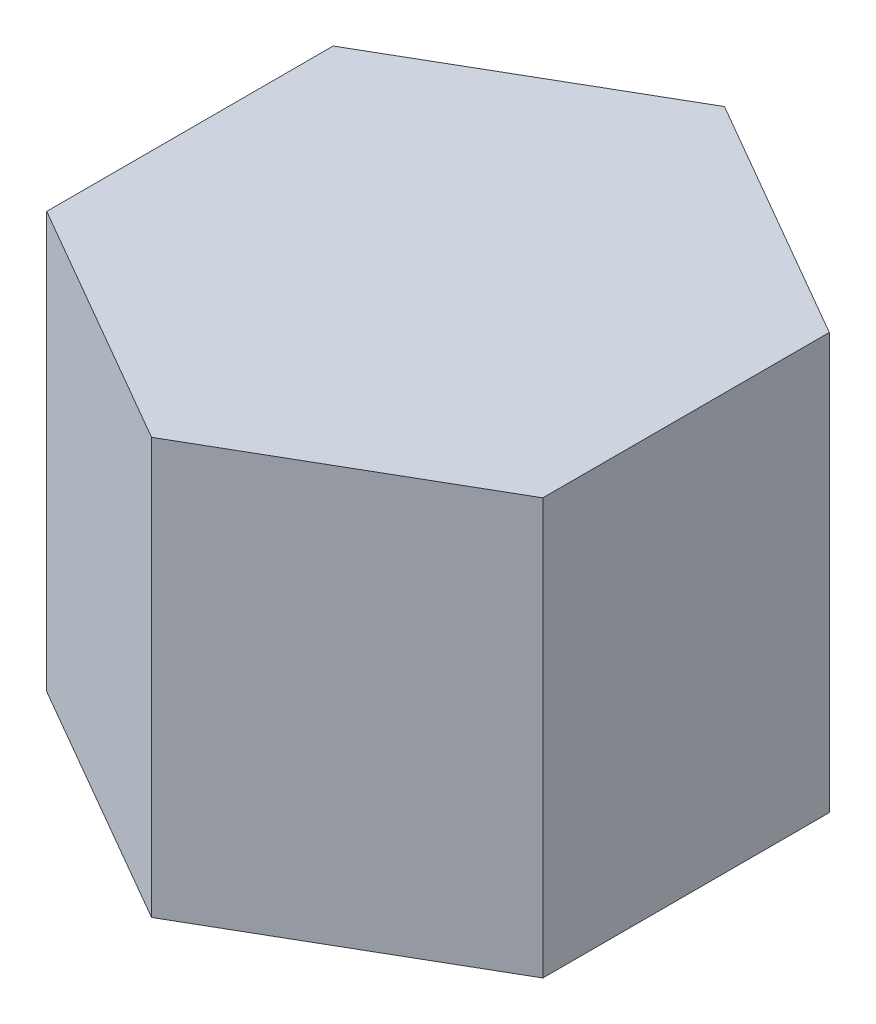
ISO-10303-21;
HEADER;
FILE_DESCRIPTION(('STEP AP214'),'2;1');
FILE_NAME('part.step','',(''),(''),'','','');
FILE_SCHEMA(('AUTOMOTIVE_DESIGN { 1 0 10303 214 1 1 1 1 }'));
ENDSEC;
DATA;
#1=APPLICATION_CONTEXT('core data for automotive mechanical design processes');
#2=APPLICATION_PROTOCOL_DEFINITION('international standard','automotive_design',2000,#1);
#3=PRODUCT_CONTEXT('',#1,'mechanical');
#4=PRODUCT('Part','Part','',(#3));
#5=PRODUCT_RELATED_PRODUCT_CATEGORY('part','',(#4));
#6=PRODUCT_DEFINITION_FORMATION('','',#4);
#7=PRODUCT_DEFINITION_CONTEXT('part definition',#1,'design');
#8=PRODUCT_DEFINITION('design','',#6,#7);
#9=PRODUCT_DEFINITION_SHAPE('','',#8);
#10=(LENGTH_UNIT() NAMED_UNIT(*) SI_UNIT(.MILLI.,.METRE.));
#11=(NAMED_UNIT(*) PLANE_ANGLE_UNIT() SI_UNIT($,.RADIAN.));
#12=(NAMED_UNIT(*) SI_UNIT($,.STERADIAN.) SOLID_ANGLE_UNIT());
#13=UNCERTAINTY_MEASURE_WITH_UNIT(LENGTH_MEASURE(1.E-05),#10,'distance_accuracy_value','');
#14=(GEOMETRIC_REPRESENTATION_CONTEXT(3) GLOBAL_UNCERTAINTY_ASSIGNED_CONTEXT((#13)) GLOBAL_UNIT_ASSIGNED_CONTEXT((#10,
#11,#12)) REPRESENTATION_CONTEXT('',''));
#15=CARTESIAN_POINT('',(0.,0.,0.));
#16=DIRECTION('',(0.,0.,1.));
#17=DIRECTION('',(1.,0.,0.));
#18=AXIS2_PLACEMENT_3D('',#15,#16,#17);
#19=CARTESIAN_POINT('',(209.142660308706,-148.537700895744,290.64094581671));
#20=DIRECTION('',(-0.499999999999909,0.,-0.866025403784491));
#21=DIRECTION('',(-0.866025403784491,0.,0.499999999999909));
#22=AXIS2_PLACEMENT_3D('',#19,#20,#21);
#23=PLANE('',#22);
#24=CARTESIAN_POINT('',(208.839551417382,-149.045793579175,290.81594581671));
#25=DIRECTION('',(0.866025403784491,0.,-0.499999999999909));
#26=VECTOR('',#25,1.);
#27=LINE('',#24,#26);
#28=CARTESIAN_POINT('',(208.839551417382,-149.045793579175,290.81594581671));
#29=VERTEX_POINT('',#28);
#30=CARTESIAN_POINT('',(209.142660308706,-149.045793579175,290.64094581671));
#31=VERTEX_POINT('',#30);
#32=EDGE_CURVE('E170',#29,#31,#27,.T.);
#33=ORIENTED_EDGE('',*,*,#32,.T.);
#34=CARTESIAN_POINT('',(209.142660308706,-148.537700895744,290.64094581671));
#35=DIRECTION('',(0.,-1.,0.));
#36=VECTOR('',#35,1.);
#37=LINE('',#34,#36);
#38=CARTESIAN_POINT('',(209.142660308706,-148.537700895744,290.64094581671));
#39=VERTEX_POINT('',#38);
#40=EDGE_CURVE('E35',#39,#31,#37,.T.);
#41=ORIENTED_EDGE('',*,*,#40,.F.);
#42=CARTESIAN_POINT('',(208.839551417382,-148.537700895744,290.81594581671));
#43=DIRECTION('',(0.866025403784491,0.,-0.499999999999909));
#44=VECTOR('',#43,1.);
#45=LINE('',#42,#44);
#46=CARTESIAN_POINT('',(208.839551417382,-148.537700895744,290.81594581671));
#47=VERTEX_POINT('',#46);
#48=EDGE_CURVE('E159',#47,#39,#45,.T.);
#49=ORIENTED_EDGE('',*,*,#48,.F.);
#50=CARTESIAN_POINT('',(208.839551417382,-148.537700895744,290.81594581671));
#51=DIRECTION('',(0.,-1.,0.));
#52=VECTOR('',#51,1.);
#53=LINE('',#50,#52);
#54=EDGE_CURVE('E10',#47,#29,#53,.T.);
#55=ORIENTED_EDGE('',*,*,#54,.T.);
#56=EDGE_LOOP('',(#33,#41,#49,#55));
#57=FACE_BOUND('',#56,.T.);
#58=ADVANCED_FACE('F16',(#57),#23,.F.);
#59=CARTESIAN_POINT('',(208.839551417382,-148.537700895744,290.81594581671));
#60=DIRECTION('',(0.500000000000096,0.,-0.866025403784383));
#61=DIRECTION('',(-0.866025403784383,0.,-0.500000000000096));
#62=AXIS2_PLACEMENT_3D('',#59,#60,#61);
#63=PLANE('',#62);
#64=CARTESIAN_POINT('',(208.536442526057,-149.045793579175,290.64094581671));
#65=DIRECTION('',(0.866025403784383,0.,0.500000000000096));
#66=VECTOR('',#65,1.);
#67=LINE('',#64,#66);
#68=CARTESIAN_POINT('',(208.536442526057,-149.045793579175,290.64094581671));
#69=VERTEX_POINT('',#68);
#70=EDGE_CURVE('E167',#69,#29,#67,.T.);
#71=ORIENTED_EDGE('',*,*,#70,.T.);
#72=ORIENTED_EDGE('',*,*,#54,.F.);
#73=CARTESIAN_POINT('',(208.536442526057,-148.537700895744,290.64094581671));
#74=DIRECTION('',(0.866025403784383,0.,0.500000000000096));
#75=VECTOR('',#74,1.);
#76=LINE('',#73,#75);
#77=CARTESIAN_POINT('',(208.536442526057,-148.537700895744,290.64094581671));
#78=VERTEX_POINT('',#77);
#79=EDGE_CURVE('E156',#78,#47,#76,.T.);
#80=ORIENTED_EDGE('',*,*,#79,.F.);
#81=CARTESIAN_POINT('',(208.536442526057,-148.537700895744,290.64094581671));
#82=DIRECTION('',(0.,-1.,0.));
#83=VECTOR('',#82,1.);
#84=LINE('',#81,#83);
#85=EDGE_CURVE('E27',#78,#69,#84,.T.);
#86=ORIENTED_EDGE('',*,*,#85,.T.);
#87=EDGE_LOOP('',(#71,#72,#80,#86));
#88=FACE_BOUND('',#87,.T.);
#89=ADVANCED_FACE('F189',(#88),#63,.F.);
#90=CARTESIAN_POINT('',(208.536442526057,-148.537700895744,290.831971220494));
#91=DIRECTION('',(1.,0.,0.));
#92=DIRECTION('',(0.,1.,0.));
#93=AXIS2_PLACEMENT_3D('',#90,#91,#92);
#94=PLANE('',#93);
#95=CARTESIAN_POINT('',(208.536442526057,-149.045793579175,290.29094581671));
#96=DIRECTION('',(0.,0.,1.));
#97=VECTOR('',#96,1.);
#98=LINE('',#95,#97);
#99=CARTESIAN_POINT('',(208.536442526057,-149.045793579175,290.29094581671));
#100=VERTEX_POINT('',#99);
#101=EDGE_CURVE('E163',#100,#69,#98,.T.);
#102=ORIENTED_EDGE('',*,*,#101,.T.);
#103=ORIENTED_EDGE('',*,*,#85,.F.);
#104=CARTESIAN_POINT('',(208.536442526057,-148.537700895744,290.29094581671));
#105=DIRECTION('',(0.,0.,1.));
#106=VECTOR('',#105,1.);
#107=LINE('',#104,#106);
#108=CARTESIAN_POINT('',(208.536442526057,-148.537700895744,290.29094581671));
#109=VERTEX_POINT('',#108);
#110=EDGE_CURVE('E106',#109,#78,#107,.T.);
#111=ORIENTED_EDGE('',*,*,#110,.F.);
#112=CARTESIAN_POINT('',(208.536442526057,-148.537700895744,290.29094581671));
#113=DIRECTION('',(0.,-1.,0.));
#114=VECTOR('',#113,1.);
#115=LINE('',#112,#114);
#116=EDGE_CURVE('E94',#109,#100,#115,.T.);
#117=ORIENTED_EDGE('',*,*,#116,.T.);
#118=EDGE_LOOP('',(#102,#103,#111,#117));
#119=FACE_BOUND('',#118,.T.);
#120=ADVANCED_FACE('F198',(#119),#94,.F.);
#121=CARTESIAN_POINT('',(208.536442526057,-148.537700895744,290.29094581671));
#122=DIRECTION('',(0.499999999999943,0.,0.866025403784472));
#123=DIRECTION('',(0.866025403784472,0.,-0.499999999999943));
#124=AXIS2_PLACEMENT_3D('',#121,#122,#123);
#125=PLANE('',#124);
#126=CARTESIAN_POINT('',(208.839551417382,-149.045793579175,290.11594581671));
#127=DIRECTION('',(-0.866025403784471,0.,0.499999999999943));
#128=VECTOR('',#127,1.);
#129=LINE('',#126,#128);
#130=CARTESIAN_POINT('',(208.839551417382,-149.045793579175,290.11594581671));
#131=VERTEX_POINT('',#130);
#132=EDGE_CURVE('E162',#131,#100,#129,.T.);
#133=ORIENTED_EDGE('',*,*,#132,.T.);
#134=ORIENTED_EDGE('',*,*,#116,.F.);
#135=CARTESIAN_POINT('',(208.839551417382,-148.537700895744,290.11594581671));
#136=DIRECTION('',(-0.866025403784471,0.,0.499999999999943));
#137=VECTOR('',#136,1.);
#138=LINE('',#135,#137);
#139=CARTESIAN_POINT('',(208.839551417382,-148.537700895744,290.11594581671));
#140=VERTEX_POINT('',#139);
#141=EDGE_CURVE('E98',#140,#109,#138,.T.);
#142=ORIENTED_EDGE('',*,*,#141,.F.);
#143=CARTESIAN_POINT('',(208.839551417382,-148.537700895744,290.11594581671));
#144=DIRECTION('',(0.,-1.,0.));
#145=VECTOR('',#144,1.);
#146=LINE('',#143,#145);
#147=EDGE_CURVE('E79',#140,#131,#146,.T.);
#148=ORIENTED_EDGE('',*,*,#147,.T.);
#149=EDGE_LOOP('',(#133,#134,#142,#148));
#150=FACE_BOUND('',#149,.T.);
#151=ADVANCED_FACE('F100',(#150),#125,.F.);
#152=CARTESIAN_POINT('',(208.839551417382,-148.537700895744,290.11594581671));
#153=DIRECTION('',(-0.500000000000062,0.,0.866025403784403));
#154=DIRECTION('',(0.866025403784403,0.,0.500000000000062));
#155=AXIS2_PLACEMENT_3D('',#152,#153,#154);
#156=PLANE('',#155);
#157=CARTESIAN_POINT('',(209.142660308706,-149.045793579175,290.29094581671));
#158=DIRECTION('',(-0.866025403784403,0.,-0.500000000000062));
#159=VECTOR('',#158,1.);
#160=LINE('',#157,#159);
#161=CARTESIAN_POINT('',(209.142660308706,-149.045793579175,290.29094581671));
#162=VERTEX_POINT('',#161);
#163=EDGE_CURVE('E88',#162,#131,#160,.T.);
#164=ORIENTED_EDGE('',*,*,#163,.T.);
#165=ORIENTED_EDGE('',*,*,#147,.F.);
#166=CARTESIAN_POINT('',(209.142660308706,-148.537700895744,290.29094581671));
#167=DIRECTION('',(-0.866025403784403,0.,-0.500000000000062));
#168=VECTOR('',#167,1.);
#169=LINE('',#166,#168);
#170=CARTESIAN_POINT('',(209.142660308706,-148.537700895744,290.29094581671));
#171=VERTEX_POINT('',#170);
#172=EDGE_CURVE('E84',#171,#140,#169,.T.);
#173=ORIENTED_EDGE('',*,*,#172,.F.);
#174=CARTESIAN_POINT('',(209.142660308706,-148.537700895744,290.29094581671));
#175=DIRECTION('',(0.,-1.,0.));
#176=VECTOR('',#175,1.);
#177=LINE('',#174,#176);
#178=EDGE_CURVE('E58',#171,#162,#177,.T.);
#179=ORIENTED_EDGE('',*,*,#178,.T.);
#180=EDGE_LOOP('',(#164,#165,#173,#179));
#181=FACE_BOUND('',#180,.T.);
#182=ADVANCED_FACE('F82',(#181),#156,.F.);
#183=CARTESIAN_POINT('',(209.142660308706,-148.537700895744,290.831971220494));
#184=DIRECTION('',(-1.,0.,0.));
#185=DIRECTION('',(0.,-1.,0.));
#186=AXIS2_PLACEMENT_3D('',#183,#184,#185);
#187=PLANE('',#186);
#188=CARTESIAN_POINT('',(209.142660308706,-149.045793579175,290.64094581671));
#189=DIRECTION('',(0.,0.,-1.));
#190=VECTOR('',#189,1.);
#191=LINE('',#188,#190);
#192=EDGE_CURVE('E160',#31,#162,#191,.T.);
#193=ORIENTED_EDGE('',*,*,#192,.T.);
#194=ORIENTED_EDGE('',*,*,#178,.F.);
#195=CARTESIAN_POINT('',(209.142660308706,-148.537700895744,290.64094581671));
#196=DIRECTION('',(0.,0.,-1.));
#197=VECTOR('',#196,1.);
#198=LINE('',#195,#197);
#199=EDGE_CURVE('E112',#39,#171,#198,.T.);
#200=ORIENTED_EDGE('',*,*,#199,.F.);
#201=ORIENTED_EDGE('',*,*,#40,.T.);
#202=EDGE_LOOP('',(#193,#194,#200,#201));
#203=FACE_BOUND('',#202,.T.);
#204=ADVANCED_FACE('F131',(#203),#187,.F.);
#205=CARTESIAN_POINT('',(206.339551417382,-148.537700895744,290.831971220494));
#206=DIRECTION('',(0.,-1.,0.));
#207=DIRECTION('',(1.,0.,0.));
#208=AXIS2_PLACEMENT_3D('',#205,#206,#207);
#209=PLANE('',#208);
#210=ORIENTED_EDGE('',*,*,#48,.T.);
#211=ORIENTED_EDGE('',*,*,#199,.T.);
#212=ORIENTED_EDGE('',*,*,#172,.T.);
#213=ORIENTED_EDGE('',*,*,#141,.T.);
#214=ORIENTED_EDGE('',*,*,#110,.T.);
#215=ORIENTED_EDGE('',*,*,#79,.T.);
#216=EDGE_LOOP('',(#210,#211,#212,#213,#214,#215));
#217=FACE_BOUND('',#216,.T.);
#218=ADVANCED_FACE('F111',(#217),#209,.F.);
#219=CARTESIAN_POINT('',(206.339551417382,-149.045793579175,290.831971220494));
#220=DIRECTION('',(0.,-1.,0.));
#221=DIRECTION('',(1.,0.,0.));
#222=AXIS2_PLACEMENT_3D('',#219,#220,#221);
#223=PLANE('',#222);
#224=ORIENTED_EDGE('',*,*,#32,.F.);
#225=ORIENTED_EDGE('',*,*,#70,.F.);
#226=ORIENTED_EDGE('',*,*,#101,.F.);
#227=ORIENTED_EDGE('',*,*,#132,.F.);
#228=ORIENTED_EDGE('',*,*,#163,.F.);
#229=ORIENTED_EDGE('',*,*,#192,.F.);
#230=EDGE_LOOP('',(#224,#225,#226,#227,#228,#229));
#231=FACE_BOUND('',#230,.T.);
#232=ADVANCED_FACE('F130',(#231),#223,.T.);
#233=CLOSED_SHELL('',(#58,#89,#120,#151,#182,#204,#218,#232));
#234=MANIFOLD_SOLID_BREP('B1',#233);
#235=ADVANCED_BREP_SHAPE_REPRESENTATION('',(#18,#234),#14);
#236=SHAPE_DEFINITION_REPRESENTATION(#9,#235);
ENDSEC;
END-ISO-10303-21;
